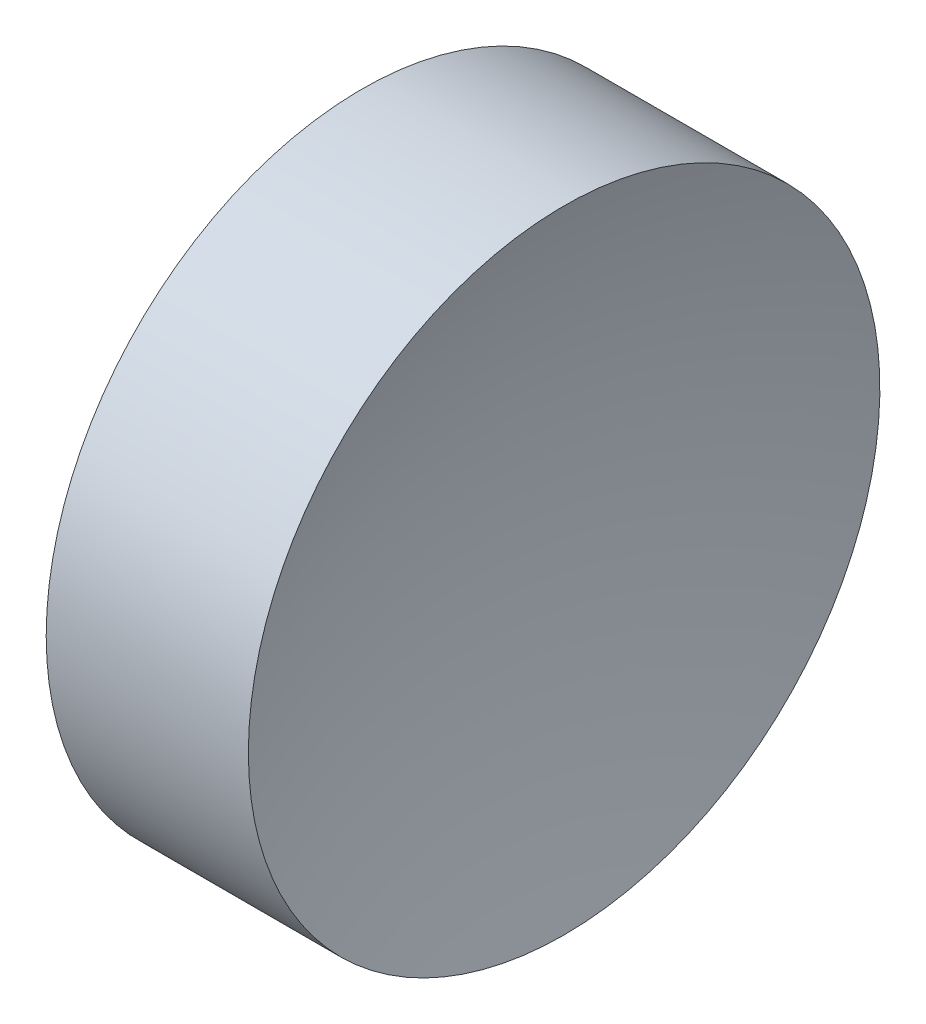
ISO-10303-21;
HEADER;
FILE_DESCRIPTION(('STEP AP214'),'2;1');
FILE_NAME('part.step','',(''),(''),'','','');
FILE_SCHEMA(('AUTOMOTIVE_DESIGN { 1 0 10303 214 1 1 1 1 }'));
ENDSEC;
DATA;
#1=APPLICATION_CONTEXT('core data for automotive mechanical design processes');
#2=APPLICATION_PROTOCOL_DEFINITION('international standard','automotive_design',2000,#1);
#3=PRODUCT_CONTEXT('',#1,'mechanical');
#4=PRODUCT('Part','Part','',(#3));
#5=PRODUCT_RELATED_PRODUCT_CATEGORY('part','',(#4));
#6=PRODUCT_DEFINITION_FORMATION('','',#4);
#7=PRODUCT_DEFINITION_CONTEXT('part definition',#1,'design');
#8=PRODUCT_DEFINITION('design','',#6,#7);
#9=PRODUCT_DEFINITION_SHAPE('','',#8);
#10=(LENGTH_UNIT() NAMED_UNIT(*) SI_UNIT(.MILLI.,.METRE.));
#11=(NAMED_UNIT(*) PLANE_ANGLE_UNIT() SI_UNIT($,.RADIAN.));
#12=(NAMED_UNIT(*) SI_UNIT($,.STERADIAN.) SOLID_ANGLE_UNIT());
#13=UNCERTAINTY_MEASURE_WITH_UNIT(LENGTH_MEASURE(1.E-05),#10,'distance_accuracy_value','');
#14=(GEOMETRIC_REPRESENTATION_CONTEXT(3) GLOBAL_UNCERTAINTY_ASSIGNED_CONTEXT((#13)) GLOBAL_UNIT_ASSIGNED_CONTEXT((#10,
#11,#12)) REPRESENTATION_CONTEXT('',''));
#15=CARTESIAN_POINT('',(0.,0.,0.));
#16=DIRECTION('',(0.,0.,1.));
#17=DIRECTION('',(1.,0.,0.));
#18=AXIS2_PLACEMENT_3D('',#15,#16,#17);
#19=CARTESIAN_POINT('',(161.09265553492,69.3780211233724,0.));
#20=DIRECTION('',(-1.,0.,0.));
#21=DIRECTION('',(0.,-1.,0.));
#22=AXIS2_PLACEMENT_3D('',#19,#20,#21);
#23=SPHERICAL_SURFACE('',#22,40.);
#24=CARTESIAN_POINT('',(123.095945150993,69.3780211233724,0.));
#25=DIRECTION('',(-1.,0.,0.));
#26=DIRECTION('',(0.,0.,1.));
#27=AXIS2_PLACEMENT_3D('',#24,#25,#26);
#28=CIRCLE('',#27,12.5);
#29=CARTESIAN_POINT('',(123.095945150993,69.3780211233724,12.5));
#30=VERTEX_POINT('',#29);
#31=EDGE_CURVE('E10',#30,#30,#28,.T.);
#32=ORIENTED_EDGE('',*,*,#31,.F.);
#33=EDGE_LOOP('',(#32));
#34=FACE_BOUND('',#33,.T.);
#35=ADVANCED_FACE('F35',(#34),#23,.F.);
#36=CARTESIAN_POINT('',(108.985143002165,69.3780211233724,0.));
#37=DIRECTION('',(-1.,0.,0.));
#38=DIRECTION('',(0.,0.,1.));
#39=AXIS2_PLACEMENT_3D('',#36,#37,#38);
#40=CYLINDRICAL_SURFACE('',#39,12.5);
#41=CARTESIAN_POINT('',(115.09265553492,69.3780211233724,0.));
#42=DIRECTION('',(-1.,0.,0.));
#43=DIRECTION('',(0.,0.,1.));
#44=AXIS2_PLACEMENT_3D('',#41,#42,#43);
#45=CIRCLE('',#44,12.5);
#46=CARTESIAN_POINT('',(115.09265553492,69.3780211233724,12.5));
#47=VERTEX_POINT('',#46);
#48=EDGE_CURVE('E41',#47,#47,#45,.T.);
#49=ORIENTED_EDGE('',*,*,#48,.F.);
#50=EDGE_LOOP('',(#49));
#51=FACE_BOUND('',#50,.T.);
#52=ORIENTED_EDGE('',*,*,#31,.T.);
#53=EDGE_LOOP('',(#52));
#54=FACE_BOUND('',#53,.T.);
#55=ADVANCED_FACE('F49',(#51,#54),#40,.T.);
#56=CARTESIAN_POINT('',(115.09265553492,69.3780211233724,0.));
#57=DIRECTION('',(1.,0.,0.));
#58=DIRECTION('',(0.,0.,-1.));
#59=AXIS2_PLACEMENT_3D('',#56,#57,#58);
#60=PLANE('',#59);
#61=ORIENTED_EDGE('',*,*,#48,.T.);
#62=EDGE_LOOP('',(#61));
#63=FACE_BOUND('',#62,.T.);
#64=ADVANCED_FACE('F47',(#63),#60,.F.);
#65=CLOSED_SHELL('',(#35,#55,#64));
#66=MANIFOLD_SOLID_BREP('B2',#65);
#67=ADVANCED_BREP_SHAPE_REPRESENTATION('',(#18,#66),#14);
#68=SHAPE_DEFINITION_REPRESENTATION(#9,#67);
ENDSEC;
END-ISO-10303-21;
